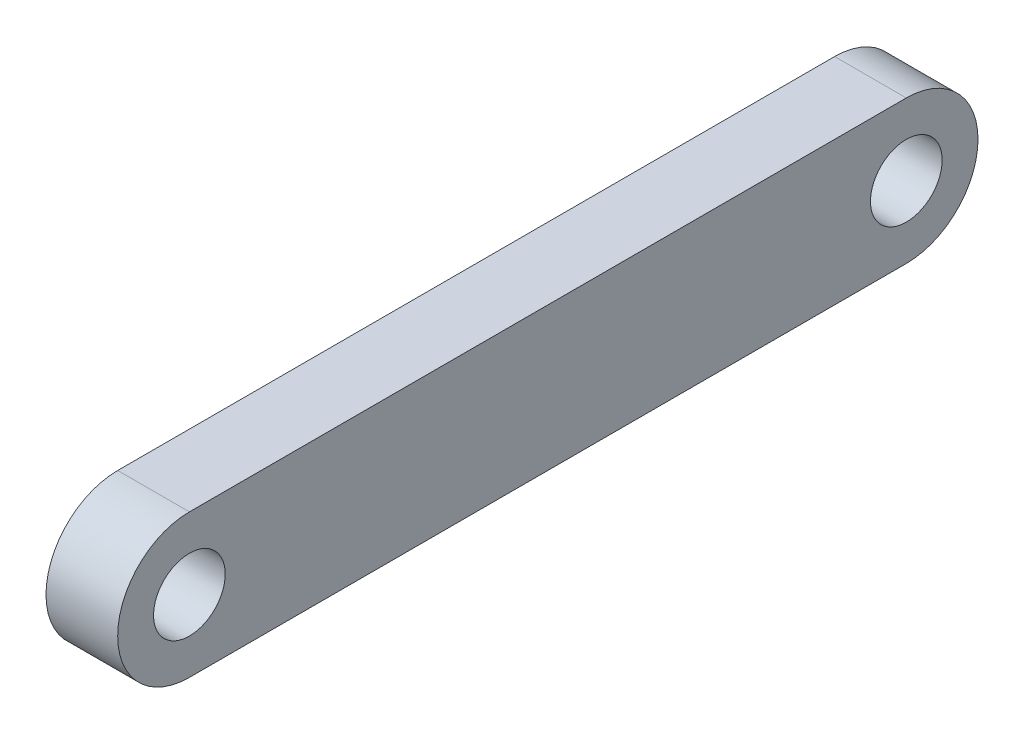
ISO-10303-21;
HEADER;
FILE_DESCRIPTION(('STEP AP214'),'2;1');
FILE_NAME('part.step','',(''),(''),'','','');
FILE_SCHEMA(('AUTOMOTIVE_DESIGN { 1 0 10303 214 1 1 1 1 }'));
ENDSEC;
DATA;
#1=APPLICATION_CONTEXT('core data for automotive mechanical design processes');
#2=APPLICATION_PROTOCOL_DEFINITION('international standard','automotive_design',2000,#1);
#3=PRODUCT_CONTEXT('',#1,'mechanical');
#4=PRODUCT('Part','Part','',(#3));
#5=PRODUCT_RELATED_PRODUCT_CATEGORY('part','',(#4));
#6=PRODUCT_DEFINITION_FORMATION('','',#4);
#7=PRODUCT_DEFINITION_CONTEXT('part definition',#1,'design');
#8=PRODUCT_DEFINITION('design','',#6,#7);
#9=PRODUCT_DEFINITION_SHAPE('','',#8);
#10=(LENGTH_UNIT() NAMED_UNIT(*) SI_UNIT(.MILLI.,.METRE.));
#11=(NAMED_UNIT(*) PLANE_ANGLE_UNIT() SI_UNIT($,.RADIAN.));
#12=(NAMED_UNIT(*) SI_UNIT($,.STERADIAN.) SOLID_ANGLE_UNIT());
#13=UNCERTAINTY_MEASURE_WITH_UNIT(LENGTH_MEASURE(1.E-05),#10,'distance_accuracy_value','');
#14=(GEOMETRIC_REPRESENTATION_CONTEXT(3) GLOBAL_UNCERTAINTY_ASSIGNED_CONTEXT((#13)) GLOBAL_UNIT_ASSIGNED_CONTEXT((#10,
#11,#12)) REPRESENTATION_CONTEXT('',''));
#15=CARTESIAN_POINT('',(0.,0.,0.));
#16=DIRECTION('',(0.,0.,1.));
#17=DIRECTION('',(1.,0.,0.));
#18=AXIS2_PLACEMENT_3D('',#15,#16,#17);
#19=CARTESIAN_POINT('',(8.,-7.99999999999999,0.));
#20=DIRECTION('',(0.,1.,0.));
#21=DIRECTION('',(0.,0.,1.));
#22=AXIS2_PLACEMENT_3D('',#19,#20,#21);
#23=PLANE('',#22);
#24=DIRECTION('',(0.,0.,-1.));
#25=VECTOR('',#24,1.);
#26=CARTESIAN_POINT('',(0.,-7.99999999999999,0.));
#27=LINE('',#26,#25);
#28=CARTESIAN_POINT('',(0.,-7.99999999999999,40.));
#29=VERTEX_POINT('',#28);
#30=CARTESIAN_POINT('',(0.,-7.99999999999999,-40.));
#31=VERTEX_POINT('',#30);
#32=EDGE_CURVE('E105',#29,#31,#27,.T.);
#33=ORIENTED_EDGE('',*,*,#32,.T.);
#34=DIRECTION('',(-1.,0.,0.));
#35=VECTOR('',#34,1.);
#36=CARTESIAN_POINT('',(8.,-7.99999999999999,-40.));
#37=LINE('',#36,#35);
#38=CARTESIAN_POINT('',(8.,-7.99999999999999,-40.));
#39=VERTEX_POINT('',#38);
#40=EDGE_CURVE('E11',#39,#31,#37,.T.);
#41=ORIENTED_EDGE('',*,*,#40,.F.);
#42=DIRECTION('',(0.,0.,-1.));
#43=VECTOR('',#42,1.);
#44=CARTESIAN_POINT('',(8.,-7.99999999999999,0.));
#45=LINE('',#44,#43);
#46=CARTESIAN_POINT('',(8.,-7.99999999999999,40.));
#47=VERTEX_POINT('',#46);
#48=EDGE_CURVE('E85',#47,#39,#45,.T.);
#49=ORIENTED_EDGE('',*,*,#48,.F.);
#50=DIRECTION('',(-1.,0.,0.));
#51=VECTOR('',#50,1.);
#52=CARTESIAN_POINT('',(8.,-7.99999999999999,40.));
#53=LINE('',#52,#51);
#54=EDGE_CURVE('E52',#47,#29,#53,.T.);
#55=ORIENTED_EDGE('',*,*,#54,.T.);
#56=EDGE_LOOP('',(#33,#41,#49,#55));
#57=FACE_BOUND('',#56,.T.);
#58=ADVANCED_FACE('F35',(#57),#23,.F.);
#59=CARTESIAN_POINT('',(8.,0.,-40.));
#60=DIRECTION('',(-1.,0.,0.));
#61=DIRECTION('',(0.,0.,1.));
#62=AXIS2_PLACEMENT_3D('',#59,#60,#61);
#63=CYLINDRICAL_SURFACE('',#62,7.99999999999999);
#64=CARTESIAN_POINT('',(0.,0.,-40.));
#65=DIRECTION('',(1.,0.,0.));
#66=DIRECTION('',(0.,0.,-1.));
#67=AXIS2_PLACEMENT_3D('',#64,#65,#66);
#68=CIRCLE('',#67,7.99999999999999);
#69=CARTESIAN_POINT('',(0.,7.99999999999998,-40.));
#70=VERTEX_POINT('',#69);
#71=EDGE_CURVE('E90',#31,#70,#68,.T.);
#72=ORIENTED_EDGE('',*,*,#71,.T.);
#73=DIRECTION('',(-1.,0.,0.));
#74=VECTOR('',#73,1.);
#75=CARTESIAN_POINT('',(8.,7.99999999999998,-40.));
#76=LINE('',#75,#74);
#77=CARTESIAN_POINT('',(8.,7.99999999999998,-40.));
#78=VERTEX_POINT('',#77);
#79=EDGE_CURVE('E44',#78,#70,#76,.T.);
#80=ORIENTED_EDGE('',*,*,#79,.F.);
#81=CARTESIAN_POINT('',(8.,0.,-40.));
#82=DIRECTION('',(1.,0.,0.));
#83=DIRECTION('',(0.,0.,-1.));
#84=AXIS2_PLACEMENT_3D('',#81,#82,#83);
#85=CIRCLE('',#84,7.99999999999999);
#86=EDGE_CURVE('E77',#39,#78,#85,.T.);
#87=ORIENTED_EDGE('',*,*,#86,.F.);
#88=ORIENTED_EDGE('',*,*,#40,.T.);
#89=EDGE_LOOP('',(#72,#80,#87,#88));
#90=FACE_BOUND('',#89,.T.);
#91=ADVANCED_FACE('F89',(#90),#63,.T.);
#92=CARTESIAN_POINT('',(8.,7.99999999999998,0.));
#93=DIRECTION('',(0.,1.,0.));
#94=DIRECTION('',(0.,0.,1.));
#95=AXIS2_PLACEMENT_3D('',#92,#93,#94);
#96=PLANE('',#95);
#97=DIRECTION('',(0.,0.,-1.));
#98=VECTOR('',#97,1.);
#99=CARTESIAN_POINT('',(0.,7.99999999999998,0.));
#100=LINE('',#99,#98);
#101=CARTESIAN_POINT('',(0.,7.99999999999998,40.));
#102=VERTEX_POINT('',#101);
#103=EDGE_CURVE('E108',#102,#70,#100,.T.);
#104=ORIENTED_EDGE('',*,*,#103,.F.);
#105=DIRECTION('',(-1.,0.,0.));
#106=VECTOR('',#105,1.);
#107=CARTESIAN_POINT('',(8.,7.99999999999998,40.));
#108=LINE('',#107,#106);
#109=CARTESIAN_POINT('',(8.,7.99999999999998,40.));
#110=VERTEX_POINT('',#109);
#111=EDGE_CURVE('E66',#110,#102,#108,.T.);
#112=ORIENTED_EDGE('',*,*,#111,.F.);
#113=DIRECTION('',(0.,0.,-1.));
#114=VECTOR('',#113,1.);
#115=CARTESIAN_POINT('',(8.,7.99999999999998,0.));
#116=LINE('',#115,#114);
#117=EDGE_CURVE('E84',#110,#78,#116,.T.);
#118=ORIENTED_EDGE('',*,*,#117,.T.);
#119=ORIENTED_EDGE('',*,*,#79,.T.);
#120=EDGE_LOOP('',(#104,#112,#118,#119));
#121=FACE_BOUND('',#120,.T.);
#122=ADVANCED_FACE('F93',(#121),#96,.T.);
#123=CARTESIAN_POINT('',(8.,0.,40.));
#124=DIRECTION('',(-1.,0.,0.));
#125=DIRECTION('',(0.,0.,1.));
#126=AXIS2_PLACEMENT_3D('',#123,#124,#125);
#127=CYLINDRICAL_SURFACE('',#126,4.00000000000001);
#128=CARTESIAN_POINT('',(8.,0.,40.));
#129=DIRECTION('',(1.,0.,0.));
#130=DIRECTION('',(0.,0.,-1.));
#131=AXIS2_PLACEMENT_3D('',#128,#129,#130);
#132=CIRCLE('',#131,4.00000000000001);
#133=CARTESIAN_POINT('',(8.,0.,36.));
#134=VERTEX_POINT('',#133);
#135=EDGE_CURVE('E117',#134,#134,#132,.T.);
#136=ORIENTED_EDGE('',*,*,#135,.T.);
#137=EDGE_LOOP('',(#136));
#138=FACE_BOUND('',#137,.T.);
#139=CARTESIAN_POINT('',(0.,0.,40.));
#140=DIRECTION('',(1.,0.,0.));
#141=DIRECTION('',(0.,0.,-1.));
#142=AXIS2_PLACEMENT_3D('',#139,#140,#141);
#143=CIRCLE('',#142,4.00000000000001);
#144=CARTESIAN_POINT('',(0.,0.,36.));
#145=VERTEX_POINT('',#144);
#146=EDGE_CURVE('E102',#145,#145,#143,.T.);
#147=ORIENTED_EDGE('',*,*,#146,.F.);
#148=EDGE_LOOP('',(#147));
#149=FACE_BOUND('',#148,.T.);
#150=ADVANCED_FACE('F125',(#138,#149),#127,.F.);
#151=CARTESIAN_POINT('',(8.,0.,-40.));
#152=DIRECTION('',(-1.,0.,0.));
#153=DIRECTION('',(0.,0.,1.));
#154=AXIS2_PLACEMENT_3D('',#151,#152,#153);
#155=CYLINDRICAL_SURFACE('',#154,4.00000000000001);
#156=CARTESIAN_POINT('',(8.,0.,-40.));
#157=DIRECTION('',(1.,0.,0.));
#158=DIRECTION('',(0.,0.,-1.));
#159=AXIS2_PLACEMENT_3D('',#156,#157,#158);
#160=CIRCLE('',#159,4.00000000000001);
#161=CARTESIAN_POINT('',(8.,0.,-44.));
#162=VERTEX_POINT('',#161);
#163=EDGE_CURVE('E113',#162,#162,#160,.F.);
#164=ORIENTED_EDGE('',*,*,#163,.F.);
#165=EDGE_LOOP('',(#164));
#166=FACE_BOUND('',#165,.T.);
#167=CARTESIAN_POINT('',(0.,0.,-40.));
#168=DIRECTION('',(1.,0.,0.));
#169=DIRECTION('',(0.,0.,-1.));
#170=AXIS2_PLACEMENT_3D('',#167,#168,#169);
#171=CIRCLE('',#170,4.00000000000001);
#172=CARTESIAN_POINT('',(0.,0.,-44.));
#173=VERTEX_POINT('',#172);
#174=EDGE_CURVE('E99',#173,#173,#171,.F.);
#175=ORIENTED_EDGE('',*,*,#174,.T.);
#176=EDGE_LOOP('',(#175));
#177=FACE_BOUND('',#176,.T.);
#178=ADVANCED_FACE('F37',(#166,#177),#155,.F.);
#179=CARTESIAN_POINT('',(8.,0.,40.));
#180=DIRECTION('',(-1.,0.,0.));
#181=DIRECTION('',(0.,0.,1.));
#182=AXIS2_PLACEMENT_3D('',#179,#180,#181);
#183=CYLINDRICAL_SURFACE('',#182,7.99999999999999);
#184=CARTESIAN_POINT('',(0.,0.,40.));
#185=DIRECTION('',(1.,0.,0.));
#186=DIRECTION('',(0.,0.,-1.));
#187=AXIS2_PLACEMENT_3D('',#184,#185,#186);
#188=CIRCLE('',#187,7.99999999999999);
#189=EDGE_CURVE('E110',#29,#102,#188,.F.);
#190=ORIENTED_EDGE('',*,*,#189,.F.);
#191=ORIENTED_EDGE('',*,*,#54,.F.);
#192=CARTESIAN_POINT('',(8.,0.,40.));
#193=DIRECTION('',(1.,0.,0.));
#194=DIRECTION('',(0.,0.,-1.));
#195=AXIS2_PLACEMENT_3D('',#192,#193,#194);
#196=CIRCLE('',#195,7.99999999999999);
#197=EDGE_CURVE('E94',#47,#110,#196,.F.);
#198=ORIENTED_EDGE('',*,*,#197,.T.);
#199=ORIENTED_EDGE('',*,*,#111,.T.);
#200=EDGE_LOOP('',(#190,#191,#198,#199));
#201=FACE_BOUND('',#200,.T.);
#202=ADVANCED_FACE('F130',(#201),#183,.T.);
#203=CARTESIAN_POINT('',(8.,0.,0.));
#204=DIRECTION('',(1.,0.,0.));
#205=DIRECTION('',(0.,0.,-1.));
#206=AXIS2_PLACEMENT_3D('',#203,#204,#205);
#207=PLANE('',#206);
#208=ORIENTED_EDGE('',*,*,#163,.T.);
#209=EDGE_LOOP('',(#208));
#210=FACE_BOUND('',#209,.T.);
#211=ORIENTED_EDGE('',*,*,#135,.F.);
#212=EDGE_LOOP('',(#211));
#213=FACE_BOUND('',#212,.T.);
#214=ORIENTED_EDGE('',*,*,#48,.T.);
#215=ORIENTED_EDGE('',*,*,#86,.T.);
#216=ORIENTED_EDGE('',*,*,#117,.F.);
#217=ORIENTED_EDGE('',*,*,#197,.F.);
#218=EDGE_LOOP('',(#214,#215,#216,#217));
#219=FACE_BOUND('',#218,.T.);
#220=ADVANCED_FACE('F81',(#210,#213,#219),#207,.T.);
#221=CARTESIAN_POINT('',(0.,0.,0.));
#222=DIRECTION('',(1.,0.,0.));
#223=DIRECTION('',(0.,0.,-1.));
#224=AXIS2_PLACEMENT_3D('',#221,#222,#223);
#225=PLANE('',#224);
#226=ORIENTED_EDGE('',*,*,#174,.F.);
#227=EDGE_LOOP('',(#226));
#228=FACE_BOUND('',#227,.T.);
#229=ORIENTED_EDGE('',*,*,#146,.T.);
#230=EDGE_LOOP('',(#229));
#231=FACE_BOUND('',#230,.T.);
#232=ORIENTED_EDGE('',*,*,#32,.F.);
#233=ORIENTED_EDGE('',*,*,#189,.T.);
#234=ORIENTED_EDGE('',*,*,#103,.T.);
#235=ORIENTED_EDGE('',*,*,#71,.F.);
#236=EDGE_LOOP('',(#232,#233,#234,#235));
#237=FACE_BOUND('',#236,.T.);
#238=ADVANCED_FACE('F129',(#228,#231,#237),#225,.F.);
#239=CLOSED_SHELL('',(#58,#91,#122,#150,#178,#202,#220,#238));
#240=MANIFOLD_SOLID_BREP('B2',#239);
#241=ADVANCED_BREP_SHAPE_REPRESENTATION('',(#18,#240),#14);
#242=SHAPE_DEFINITION_REPRESENTATION(#9,#241);
ENDSEC;
END-ISO-10303-21;
